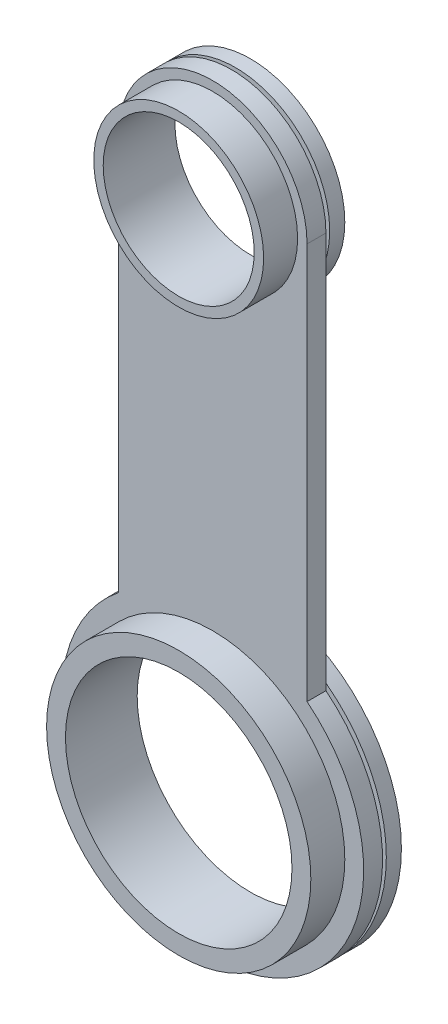
ISO-10303-21;
HEADER;
FILE_DESCRIPTION(('STEP AP214'),'2;1');
FILE_NAME('part.step','',(''),(''),'','','');
FILE_SCHEMA(('AUTOMOTIVE_DESIGN { 1 0 10303 214 1 1 1 1 }'));
ENDSEC;
DATA;
#1=APPLICATION_CONTEXT('core data for automotive mechanical design processes');
#2=APPLICATION_PROTOCOL_DEFINITION('international standard','automotive_design',2000,#1);
#3=PRODUCT_CONTEXT('',#1,'mechanical');
#4=PRODUCT('Part','Part','',(#3));
#5=PRODUCT_RELATED_PRODUCT_CATEGORY('part','',(#4));
#6=PRODUCT_DEFINITION_FORMATION('','',#4);
#7=PRODUCT_DEFINITION_CONTEXT('part definition',#1,'design');
#8=PRODUCT_DEFINITION('design','',#6,#7);
#9=PRODUCT_DEFINITION_SHAPE('','',#8);
#10=(LENGTH_UNIT() NAMED_UNIT(*) SI_UNIT(.MILLI.,.METRE.));
#11=(NAMED_UNIT(*) PLANE_ANGLE_UNIT() SI_UNIT($,.RADIAN.));
#12=(NAMED_UNIT(*) SI_UNIT($,.STERADIAN.) SOLID_ANGLE_UNIT());
#13=UNCERTAINTY_MEASURE_WITH_UNIT(LENGTH_MEASURE(1.E-05),#10,'distance_accuracy_value','');
#14=(GEOMETRIC_REPRESENTATION_CONTEXT(3) GLOBAL_UNCERTAINTY_ASSIGNED_CONTEXT((#13)) GLOBAL_UNIT_ASSIGNED_CONTEXT((#10,
#11,#12)) REPRESENTATION_CONTEXT('',''));
#15=CARTESIAN_POINT('',(0.,0.,0.));
#16=DIRECTION('',(0.,0.,1.));
#17=DIRECTION('',(1.,0.,0.));
#18=AXIS2_PLACEMENT_3D('',#15,#16,#17);
#19=CARTESIAN_POINT('',(-5.,-12.9388257575758,0.));
#20=DIRECTION('',(0.,0.,1.));
#21=DIRECTION('',(1.,0.,0.));
#22=AXIS2_PLACEMENT_3D('',#19,#20,#21);
#23=PLANE('',#22);
#24=CARTESIAN_POINT('',(-5.,-40.1838237559742,0.));
#25=DIRECTION('',(0.,0.,1.));
#26=DIRECTION('',(1.,0.,0.));
#27=AXIS2_PLACEMENT_3D('',#24,#25,#26);
#28=CIRCLE('',#27,7.);
#29=CARTESIAN_POINT('',(2.,-40.1838237559742,0.));
#30=VERTEX_POINT('',#29);
#31=EDGE_CURVE('E43',#30,#30,#28,.F.);
#32=ORIENTED_EDGE('',*,*,#31,.F.);
#33=EDGE_LOOP('',(#32));
#34=FACE_BOUND('',#33,.T.);
#35=CARTESIAN_POINT('',(-5.,-12.9388257575758,0.));
#36=DIRECTION('',(0.,0.,1.));
#37=DIRECTION('',(1.,0.,0.));
#38=AXIS2_PLACEMENT_3D('',#35,#36,#37);
#39=CIRCLE('',#38,5.);
#40=CARTESIAN_POINT('',(0.,-12.9388257575758,0.));
#41=VERTEX_POINT('',#40);
#42=CARTESIAN_POINT('',(-10.,-12.9388257575758,0.));
#43=VERTEX_POINT('',#42);
#44=EDGE_CURVE('E103',#41,#43,#39,.T.);
#45=ORIENTED_EDGE('',*,*,#44,.F.);
#46=DIRECTION('',(0.,1.,0.));
#47=VECTOR('',#46,1.);
#48=CARTESIAN_POINT('',(0.,-33.9388257575758,0.));
#49=LINE('',#48,#47);
#50=CARTESIAN_POINT('',(0.,-33.9388257575758,0.));
#51=VERTEX_POINT('',#50);
#52=EDGE_CURVE('E74',#51,#41,#49,.T.);
#53=ORIENTED_EDGE('',*,*,#52,.F.);
#54=CARTESIAN_POINT('',(-5.,-40.1838237559742,0.));
#55=DIRECTION('',(0.,0.,1.));
#56=DIRECTION('',(1.,0.,0.));
#57=AXIS2_PLACEMENT_3D('',#54,#55,#56);
#58=CIRCLE('',#57,8.);
#59=CARTESIAN_POINT('',(-10.,-33.9388257575758,0.));
#60=VERTEX_POINT('',#59);
#61=EDGE_CURVE('E68',#60,#51,#58,.T.);
#62=ORIENTED_EDGE('',*,*,#61,.F.);
#63=DIRECTION('',(0.,-1.,0.));
#64=VECTOR('',#63,1.);
#65=CARTESIAN_POINT('',(-10.,-12.9388257575758,0.));
#66=LINE('',#65,#64);
#67=EDGE_CURVE('E93',#43,#60,#66,.T.);
#68=ORIENTED_EDGE('',*,*,#67,.F.);
#69=EDGE_LOOP('',(#45,#53,#62,#68));
#70=FACE_BOUND('',#69,.T.);
#71=CARTESIAN_POINT('',(-5.,-12.9388257575758,0.));
#72=DIRECTION('',(0.,0.,1.));
#73=DIRECTION('',(1.,0.,0.));
#74=AXIS2_PLACEMENT_3D('',#71,#72,#73);
#75=CIRCLE('',#74,4.5);
#76=CARTESIAN_POINT('',(-0.499999999999998,-12.9388257575758,0.));
#77=VERTEX_POINT('',#76);
#78=EDGE_CURVE('E11',#77,#77,#75,.F.);
#79=ORIENTED_EDGE('',*,*,#78,.F.);
#80=EDGE_LOOP('',(#79));
#81=FACE_BOUND('',#80,.T.);
#82=ADVANCED_FACE('F34',(#34,#70,#81),#23,.F.);
#83=CARTESIAN_POINT('',(-5.,-12.9388257575758,1.));
#84=DIRECTION('',(0.,0.,1.));
#85=DIRECTION('',(1.,0.,0.));
#86=AXIS2_PLACEMENT_3D('',#83,#84,#85);
#87=PLANE('',#86);
#88=CARTESIAN_POINT('',(-5.,-40.1838237559742,1.));
#89=DIRECTION('',(0.,0.,1.));
#90=DIRECTION('',(1.,0.,0.));
#91=AXIS2_PLACEMENT_3D('',#88,#89,#90);
#92=CIRCLE('',#91,7.);
#93=CARTESIAN_POINT('',(2.,-40.1838237559742,1.));
#94=VERTEX_POINT('',#93);
#95=EDGE_CURVE('E182',#94,#94,#92,.T.);
#96=ORIENTED_EDGE('',*,*,#95,.F.);
#97=EDGE_LOOP('',(#96));
#98=FACE_BOUND('',#97,.T.);
#99=CARTESIAN_POINT('',(-5.,-12.9388257575758,1.));
#100=DIRECTION('',(0.,0.,1.));
#101=DIRECTION('',(1.,0.,0.));
#102=AXIS2_PLACEMENT_3D('',#99,#100,#101);
#103=CIRCLE('',#102,5.);
#104=CARTESIAN_POINT('',(0.,-12.9388257575758,1.));
#105=VERTEX_POINT('',#104);
#106=CARTESIAN_POINT('',(-10.,-12.9388257575758,1.));
#107=VERTEX_POINT('',#106);
#108=EDGE_CURVE('E88',#105,#107,#103,.T.);
#109=ORIENTED_EDGE('',*,*,#108,.T.);
#110=DIRECTION('',(0.,-1.,0.));
#111=VECTOR('',#110,1.);
#112=CARTESIAN_POINT('',(-10.,-12.9388257575758,1.));
#113=LINE('',#112,#111);
#114=CARTESIAN_POINT('',(-10.,-33.9388257575758,1.));
#115=VERTEX_POINT('',#114);
#116=EDGE_CURVE('E82',#107,#115,#113,.T.);
#117=ORIENTED_EDGE('',*,*,#116,.T.);
#118=CARTESIAN_POINT('',(-5.,-40.1838237559742,1.));
#119=DIRECTION('',(0.,0.,1.));
#120=DIRECTION('',(1.,0.,0.));
#121=AXIS2_PLACEMENT_3D('',#118,#119,#120);
#122=CIRCLE('',#121,8.);
#123=CARTESIAN_POINT('',(0.,-33.9388257575758,1.));
#124=VERTEX_POINT('',#123);
#125=EDGE_CURVE('E86',#115,#124,#122,.T.);
#126=ORIENTED_EDGE('',*,*,#125,.T.);
#127=DIRECTION('',(0.,1.,0.));
#128=VECTOR('',#127,1.);
#129=CARTESIAN_POINT('',(0.,-33.9388257575758,1.));
#130=LINE('',#129,#128);
#131=EDGE_CURVE('E51',#124,#105,#130,.T.);
#132=ORIENTED_EDGE('',*,*,#131,.T.);
#133=EDGE_LOOP('',(#109,#117,#126,#132));
#134=FACE_BOUND('',#133,.T.);
#135=CARTESIAN_POINT('',(-5.,-12.9388257575758,1.));
#136=DIRECTION('',(0.,0.,1.));
#137=DIRECTION('',(1.,0.,0.));
#138=AXIS2_PLACEMENT_3D('',#135,#136,#137);
#139=CIRCLE('',#138,4.5);
#140=CARTESIAN_POINT('',(-0.5,-12.9388257575758,1.));
#141=VERTEX_POINT('',#140);
#142=EDGE_CURVE('E191',#141,#141,#139,.T.);
#143=ORIENTED_EDGE('',*,*,#142,.F.);
#144=EDGE_LOOP('',(#143));
#145=FACE_BOUND('',#144,.T.);
#146=ADVANCED_FACE('F83',(#98,#134,#145),#87,.T.);
#147=CARTESIAN_POINT('',(-5.,-12.9388257575758,1.));
#148=DIRECTION('',(0.,0.,-1.));
#149=DIRECTION('',(-1.,0.,0.));
#150=AXIS2_PLACEMENT_3D('',#147,#148,#149);
#151=CYLINDRICAL_SURFACE('',#150,5.);
#152=ORIENTED_EDGE('',*,*,#44,.T.);
#153=DIRECTION('',(0.,0.,-1.));
#154=VECTOR('',#153,1.);
#155=CARTESIAN_POINT('',(-10.,-12.9388257575758,1.));
#156=LINE('',#155,#154);
#157=EDGE_CURVE('E94',#107,#43,#156,.T.);
#158=ORIENTED_EDGE('',*,*,#157,.F.);
#159=ORIENTED_EDGE('',*,*,#108,.F.);
#160=DIRECTION('',(0.,0.,-1.));
#161=VECTOR('',#160,1.);
#162=CARTESIAN_POINT('',(0.,-12.9388257575758,1.));
#163=LINE('',#162,#161);
#164=EDGE_CURVE('E99',#105,#41,#163,.T.);
#165=ORIENTED_EDGE('',*,*,#164,.T.);
#166=EDGE_LOOP('',(#152,#158,#159,#165));
#167=FACE_BOUND('',#166,.T.);
#168=ADVANCED_FACE('F36',(#167),#151,.T.);
#169=CARTESIAN_POINT('',(-10.,-12.9388257575758,1.));
#170=DIRECTION('',(1.,0.,0.));
#171=DIRECTION('',(0.,1.,0.));
#172=AXIS2_PLACEMENT_3D('',#169,#170,#171);
#173=PLANE('',#172);
#174=ORIENTED_EDGE('',*,*,#67,.T.);
#175=DIRECTION('',(0.,0.,-1.));
#176=VECTOR('',#175,1.);
#177=CARTESIAN_POINT('',(-10.,-33.9388257575758,1.));
#178=LINE('',#177,#176);
#179=EDGE_CURVE('E91',#115,#60,#178,.T.);
#180=ORIENTED_EDGE('',*,*,#179,.F.);
#181=ORIENTED_EDGE('',*,*,#116,.F.);
#182=ORIENTED_EDGE('',*,*,#157,.T.);
#183=EDGE_LOOP('',(#174,#180,#181,#182));
#184=FACE_BOUND('',#183,.T.);
#185=ADVANCED_FACE('F92',(#184),#173,.F.);
#186=CARTESIAN_POINT('',(-5.,-40.1838237559742,1.));
#187=DIRECTION('',(0.,0.,-1.));
#188=DIRECTION('',(-1.,0.,0.));
#189=AXIS2_PLACEMENT_3D('',#186,#187,#188);
#190=CYLINDRICAL_SURFACE('',#189,8.);
#191=ORIENTED_EDGE('',*,*,#61,.T.);
#192=DIRECTION('',(0.,0.,-1.));
#193=VECTOR('',#192,1.);
#194=CARTESIAN_POINT('',(0.,-33.9388257575758,1.));
#195=LINE('',#194,#193);
#196=EDGE_CURVE('E95',#124,#51,#195,.T.);
#197=ORIENTED_EDGE('',*,*,#196,.F.);
#198=ORIENTED_EDGE('',*,*,#125,.F.);
#199=ORIENTED_EDGE('',*,*,#179,.T.);
#200=EDGE_LOOP('',(#191,#197,#198,#199));
#201=FACE_BOUND('',#200,.T.);
#202=ADVANCED_FACE('F97',(#201),#190,.T.);
#203=CARTESIAN_POINT('',(0.,-33.9388257575758,1.));
#204=DIRECTION('',(-1.,0.,0.));
#205=DIRECTION('',(0.,0.,1.));
#206=AXIS2_PLACEMENT_3D('',#203,#204,#205);
#207=PLANE('',#206);
#208=ORIENTED_EDGE('',*,*,#52,.T.);
#209=ORIENTED_EDGE('',*,*,#164,.F.);
#210=ORIENTED_EDGE('',*,*,#131,.F.);
#211=ORIENTED_EDGE('',*,*,#196,.T.);
#212=EDGE_LOOP('',(#208,#209,#210,#211));
#213=FACE_BOUND('',#212,.T.);
#214=ADVANCED_FACE('F166',(#213),#207,.F.);
#215=CARTESIAN_POINT('',(-5.,-40.1838237559742,1.));
#216=DIRECTION('',(0.,0.,-1.));
#217=DIRECTION('',(-1.,0.,0.));
#218=AXIS2_PLACEMENT_3D('',#215,#216,#217);
#219=CYLINDRICAL_SURFACE('',#218,6.);
#220=CARTESIAN_POINT('',(-5.,-40.1838237559742,2.8));
#221=DIRECTION('',(0.,0.,1.));
#222=DIRECTION('',(1.,0.,0.));
#223=AXIS2_PLACEMENT_3D('',#220,#221,#222);
#224=CIRCLE('',#223,6.);
#225=CARTESIAN_POINT('',(0.999999999999999,-40.1838237559742,2.8));
#226=VERTEX_POINT('',#225);
#227=EDGE_CURVE('E185',#226,#226,#224,.T.);
#228=ORIENTED_EDGE('',*,*,#227,.T.);
#229=EDGE_LOOP('',(#228));
#230=FACE_BOUND('',#229,.T.);
#231=CARTESIAN_POINT('',(-5.,-40.1838237559742,-1.));
#232=DIRECTION('',(0.,0.,-1.));
#233=DIRECTION('',(-1.,0.,0.));
#234=AXIS2_PLACEMENT_3D('',#231,#232,#233);
#235=CIRCLE('',#234,6.);
#236=CARTESIAN_POINT('',(-11.,-40.1838237559742,-1.));
#237=VERTEX_POINT('',#236);
#238=EDGE_CURVE('E209',#237,#237,#235,.T.);
#239=ORIENTED_EDGE('',*,*,#238,.T.);
#240=EDGE_LOOP('',(#239));
#241=FACE_BOUND('',#240,.T.);
#242=ADVANCED_FACE('F162',(#230,#241),#219,.F.);
#243=CARTESIAN_POINT('',(-5.,-12.9388257575758,1.));
#244=DIRECTION('',(0.,0.,-1.));
#245=DIRECTION('',(-1.,0.,0.));
#246=AXIS2_PLACEMENT_3D('',#243,#244,#245);
#247=CYLINDRICAL_SURFACE('',#246,4.);
#248=CARTESIAN_POINT('',(-5.,-12.9388257575758,2.8));
#249=DIRECTION('',(0.,0.,1.));
#250=DIRECTION('',(1.,0.,0.));
#251=AXIS2_PLACEMENT_3D('',#248,#249,#250);
#252=CIRCLE('',#251,4.);
#253=CARTESIAN_POINT('',(-1.,-12.9388257575758,2.8));
#254=VERTEX_POINT('',#253);
#255=EDGE_CURVE('E194',#254,#254,#252,.T.);
#256=ORIENTED_EDGE('',*,*,#255,.T.);
#257=EDGE_LOOP('',(#256));
#258=FACE_BOUND('',#257,.T.);
#259=CARTESIAN_POINT('',(-5.,-12.9388257575758,-1.));
#260=DIRECTION('',(0.,0.,-1.));
#261=DIRECTION('',(-1.,0.,0.));
#262=AXIS2_PLACEMENT_3D('',#259,#260,#261);
#263=CIRCLE('',#262,4.);
#264=CARTESIAN_POINT('',(-9.,-12.9388257575758,-1.));
#265=VERTEX_POINT('',#264);
#266=EDGE_CURVE('E218',#265,#265,#263,.T.);
#267=ORIENTED_EDGE('',*,*,#266,.T.);
#268=EDGE_LOOP('',(#267));
#269=FACE_BOUND('',#268,.T.);
#270=ADVANCED_FACE('F155',(#258,#269),#247,.F.);
#271=CARTESIAN_POINT('',(-5.,-40.1838237559742,2.8));
#272=DIRECTION('',(0.,0.,1.));
#273=DIRECTION('',(1.,0.,0.));
#274=AXIS2_PLACEMENT_3D('',#271,#272,#273);
#275=PLANE('',#274);
#276=CARTESIAN_POINT('',(-5.,-40.1838237559742,2.8));
#277=DIRECTION('',(0.,0.,1.));
#278=DIRECTION('',(1.,0.,0.));
#279=AXIS2_PLACEMENT_3D('',#276,#277,#278);
#280=CIRCLE('',#279,7.);
#281=CARTESIAN_POINT('',(2.,-40.1838237559742,2.8));
#282=VERTEX_POINT('',#281);
#283=EDGE_CURVE('E106',#282,#282,#280,.T.);
#284=ORIENTED_EDGE('',*,*,#283,.T.);
#285=EDGE_LOOP('',(#284));
#286=FACE_BOUND('',#285,.T.);
#287=ORIENTED_EDGE('',*,*,#227,.F.);
#288=EDGE_LOOP('',(#287));
#289=FACE_BOUND('',#288,.T.);
#290=ADVANCED_FACE('F152',(#286,#289),#275,.T.);
#291=CARTESIAN_POINT('',(-5.,-40.1838237559742,2.8));
#292=DIRECTION('',(0.,0.,-1.));
#293=DIRECTION('',(-1.,0.,0.));
#294=AXIS2_PLACEMENT_3D('',#291,#292,#293);
#295=CYLINDRICAL_SURFACE('',#294,7.);
#296=ORIENTED_EDGE('',*,*,#283,.F.);
#297=EDGE_LOOP('',(#296));
#298=FACE_BOUND('',#297,.T.);
#299=ORIENTED_EDGE('',*,*,#95,.T.);
#300=EDGE_LOOP('',(#299));
#301=FACE_BOUND('',#300,.T.);
#302=ADVANCED_FACE('F147',(#298,#301),#295,.T.);
#303=CARTESIAN_POINT('',(-5.,-12.9388257575758,2.8));
#304=DIRECTION('',(0.,0.,1.));
#305=DIRECTION('',(1.,0.,0.));
#306=AXIS2_PLACEMENT_3D('',#303,#304,#305);
#307=PLANE('',#306);
#308=CARTESIAN_POINT('',(-5.,-12.9388257575758,2.8));
#309=DIRECTION('',(0.,0.,1.));
#310=DIRECTION('',(1.,0.,0.));
#311=AXIS2_PLACEMENT_3D('',#308,#309,#310);
#312=CIRCLE('',#311,4.5);
#313=CARTESIAN_POINT('',(-0.5,-12.9388257575758,2.8));
#314=VERTEX_POINT('',#313);
#315=EDGE_CURVE('E190',#314,#314,#312,.T.);
#316=ORIENTED_EDGE('',*,*,#315,.T.);
#317=EDGE_LOOP('',(#316));
#318=FACE_BOUND('',#317,.T.);
#319=ORIENTED_EDGE('',*,*,#255,.F.);
#320=EDGE_LOOP('',(#319));
#321=FACE_BOUND('',#320,.T.);
#322=ADVANCED_FACE('F144',(#318,#321),#307,.T.);
#323=CARTESIAN_POINT('',(-5.,-12.9388257575758,2.8));
#324=DIRECTION('',(0.,0.,-1.));
#325=DIRECTION('',(-1.,0.,0.));
#326=AXIS2_PLACEMENT_3D('',#323,#324,#325);
#327=CYLINDRICAL_SURFACE('',#326,4.5);
#328=ORIENTED_EDGE('',*,*,#315,.F.);
#329=EDGE_LOOP('',(#328));
#330=FACE_BOUND('',#329,.T.);
#331=ORIENTED_EDGE('',*,*,#142,.T.);
#332=EDGE_LOOP('',(#331));
#333=FACE_BOUND('',#332,.T.);
#334=ADVANCED_FACE('F136',(#330,#333),#327,.T.);
#335=CARTESIAN_POINT('',(-5.,-40.1838237559742,-0.2));
#336=DIRECTION('',(0.,0.,1.));
#337=DIRECTION('',(1.,0.,0.));
#338=AXIS2_PLACEMENT_3D('',#335,#336,#337);
#339=CYLINDRICAL_SURFACE('',#338,7.);
#340=CARTESIAN_POINT('',(-5.,-40.1838237559742,-0.2));
#341=DIRECTION('',(0.,0.,-1.));
#342=DIRECTION('',(-1.,0.,0.));
#343=AXIS2_PLACEMENT_3D('',#340,#341,#342);
#344=CIRCLE('',#343,7.);
#345=CARTESIAN_POINT('',(-12.,-40.1838237559742,-0.2));
#346=VERTEX_POINT('',#345);
#347=EDGE_CURVE('E199',#346,#346,#344,.T.);
#348=ORIENTED_EDGE('',*,*,#347,.F.);
#349=EDGE_LOOP('',(#348));
#350=FACE_BOUND('',#349,.T.);
#351=ORIENTED_EDGE('',*,*,#31,.T.);
#352=EDGE_LOOP('',(#351));
#353=FACE_BOUND('',#352,.T.);
#354=ADVANCED_FACE('F115',(#350,#353),#339,.T.);
#355=CARTESIAN_POINT('',(-5.,-12.9388257575758,-0.2));
#356=DIRECTION('',(0.,0.,1.));
#357=DIRECTION('',(1.,0.,0.));
#358=AXIS2_PLACEMENT_3D('',#355,#356,#357);
#359=CYLINDRICAL_SURFACE('',#358,4.5);
#360=CARTESIAN_POINT('',(-5.,-12.9388257575758,-0.2));
#361=DIRECTION('',(0.,0.,-1.));
#362=DIRECTION('',(-1.,0.,0.));
#363=AXIS2_PLACEMENT_3D('',#360,#361,#362);
#364=CIRCLE('',#363,4.5);
#365=CARTESIAN_POINT('',(-9.5,-12.9388257575758,-0.2));
#366=VERTEX_POINT('',#365);
#367=EDGE_CURVE('E202',#366,#366,#364,.T.);
#368=ORIENTED_EDGE('',*,*,#367,.F.);
#369=EDGE_LOOP('',(#368));
#370=FACE_BOUND('',#369,.T.);
#371=ORIENTED_EDGE('',*,*,#78,.T.);
#372=EDGE_LOOP('',(#371));
#373=FACE_BOUND('',#372,.T.);
#374=ADVANCED_FACE('F124',(#370,#373),#359,.T.);
#375=CARTESIAN_POINT('',(-5.,-40.1838237559742,-1.));
#376=DIRECTION('',(0.,0.,-1.));
#377=DIRECTION('',(-1.,0.,0.));
#378=AXIS2_PLACEMENT_3D('',#375,#376,#377);
#379=PLANE('',#378);
#380=CARTESIAN_POINT('',(-5.,-40.1838237559742,-1.));
#381=DIRECTION('',(0.,0.,-1.));
#382=DIRECTION('',(-1.,0.,0.));
#383=AXIS2_PLACEMENT_3D('',#380,#381,#382);
#384=CIRCLE('',#383,7.99896203978323);
#385=CARTESIAN_POINT('',(-12.9989620397832,-40.1838237559742,-1.));
#386=VERTEX_POINT('',#385);
#387=EDGE_CURVE('E205',#386,#386,#384,.T.);
#388=ORIENTED_EDGE('',*,*,#387,.T.);
#389=EDGE_LOOP('',(#388));
#390=FACE_BOUND('',#389,.T.);
#391=ORIENTED_EDGE('',*,*,#238,.F.);
#392=EDGE_LOOP('',(#391));
#393=FACE_BOUND('',#392,.T.);
#394=ADVANCED_FACE('F126',(#390,#393),#379,.T.);
#395=CARTESIAN_POINT('',(-5.,-40.1838237559742,-0.2));
#396=DIRECTION('',(0.,0.,-1.));
#397=DIRECTION('',(-1.,0.,0.));
#398=AXIS2_PLACEMENT_3D('',#395,#396,#397);
#399=PLANE('',#398);
#400=ORIENTED_EDGE('',*,*,#347,.T.);
#401=EDGE_LOOP('',(#400));
#402=FACE_BOUND('',#401,.T.);
#403=CARTESIAN_POINT('',(-5.,-40.1838237559742,-0.2));
#404=DIRECTION('',(0.,0.,-1.));
#405=DIRECTION('',(-1.,0.,0.));
#406=AXIS2_PLACEMENT_3D('',#403,#404,#405);
#407=CIRCLE('',#406,7.99896203978323);
#408=CARTESIAN_POINT('',(-12.9989620397832,-40.1838237559742,-0.2));
#409=VERTEX_POINT('',#408);
#410=EDGE_CURVE('E206',#409,#409,#407,.T.);
#411=ORIENTED_EDGE('',*,*,#410,.F.);
#412=EDGE_LOOP('',(#411));
#413=FACE_BOUND('',#412,.T.);
#414=ADVANCED_FACE('F133',(#402,#413),#399,.F.);
#415=CARTESIAN_POINT('',(-5.,-40.1838237559742,-1.));
#416=DIRECTION('',(0.,0.,1.));
#417=DIRECTION('',(1.,0.,0.));
#418=AXIS2_PLACEMENT_3D('',#415,#416,#417);
#419=CYLINDRICAL_SURFACE('',#418,7.99896203978323);
#420=ORIENTED_EDGE('',*,*,#387,.F.);
#421=EDGE_LOOP('',(#420));
#422=FACE_BOUND('',#421,.T.);
#423=ORIENTED_EDGE('',*,*,#410,.T.);
#424=EDGE_LOOP('',(#423));
#425=FACE_BOUND('',#424,.T.);
#426=ADVANCED_FACE('F141',(#422,#425),#419,.T.);
#427=CARTESIAN_POINT('',(-5.,-12.9388257575758,-1.));
#428=DIRECTION('',(0.,0.,-1.));
#429=DIRECTION('',(-1.,0.,0.));
#430=AXIS2_PLACEMENT_3D('',#427,#428,#429);
#431=PLANE('',#430);
#432=CARTESIAN_POINT('',(-5.,-12.9388257575758,-1.));
#433=DIRECTION('',(0.,0.,-1.));
#434=DIRECTION('',(-1.,0.,0.));
#435=AXIS2_PLACEMENT_3D('',#432,#433,#434);
#436=CIRCLE('',#435,5.);
#437=CARTESIAN_POINT('',(-10.,-12.9388257575758,-1.));
#438=VERTEX_POINT('',#437);
#439=EDGE_CURVE('E214',#438,#438,#436,.T.);
#440=ORIENTED_EDGE('',*,*,#439,.T.);
#441=EDGE_LOOP('',(#440));
#442=FACE_BOUND('',#441,.T.);
#443=ORIENTED_EDGE('',*,*,#266,.F.);
#444=EDGE_LOOP('',(#443));
#445=FACE_BOUND('',#444,.T.);
#446=ADVANCED_FACE('F225',(#442,#445),#431,.T.);
#447=CARTESIAN_POINT('',(-5.,-12.9388257575758,-0.2));
#448=DIRECTION('',(0.,0.,-1.));
#449=DIRECTION('',(-1.,0.,0.));
#450=AXIS2_PLACEMENT_3D('',#447,#448,#449);
#451=PLANE('',#450);
#452=ORIENTED_EDGE('',*,*,#367,.T.);
#453=EDGE_LOOP('',(#452));
#454=FACE_BOUND('',#453,.T.);
#455=CARTESIAN_POINT('',(-5.,-12.9388257575758,-0.2));
#456=DIRECTION('',(0.,0.,-1.));
#457=DIRECTION('',(-1.,0.,0.));
#458=AXIS2_PLACEMENT_3D('',#455,#456,#457);
#459=CIRCLE('',#458,5.);
#460=CARTESIAN_POINT('',(-10.,-12.9388257575758,-0.2));
#461=VERTEX_POINT('',#460);
#462=EDGE_CURVE('E215',#461,#461,#459,.T.);
#463=ORIENTED_EDGE('',*,*,#462,.F.);
#464=EDGE_LOOP('',(#463));
#465=FACE_BOUND('',#464,.T.);
#466=ADVANCED_FACE('F227',(#454,#465),#451,.F.);
#467=CARTESIAN_POINT('',(-5.,-12.9388257575758,-1.));
#468=DIRECTION('',(0.,0.,1.));
#469=DIRECTION('',(1.,0.,0.));
#470=AXIS2_PLACEMENT_3D('',#467,#468,#469);
#471=CYLINDRICAL_SURFACE('',#470,5.);
#472=ORIENTED_EDGE('',*,*,#439,.F.);
#473=EDGE_LOOP('',(#472));
#474=FACE_BOUND('',#473,.T.);
#475=ORIENTED_EDGE('',*,*,#462,.T.);
#476=EDGE_LOOP('',(#475));
#477=FACE_BOUND('',#476,.T.);
#478=ADVANCED_FACE('F234',(#474,#477),#471,.T.);
#479=CLOSED_SHELL('',(#82,#146,#168,#185,#202,#214,#242,#270,#290,#302,#322,#334,#354,#374,#394,
#414,#426,#446,#466,#478));
#480=MANIFOLD_SOLID_BREP('B2',#479);
#481=ADVANCED_BREP_SHAPE_REPRESENTATION('',(#18,#480),#14);
#482=SHAPE_DEFINITION_REPRESENTATION(#9,#481);
ENDSEC;
END-ISO-10303-21;
